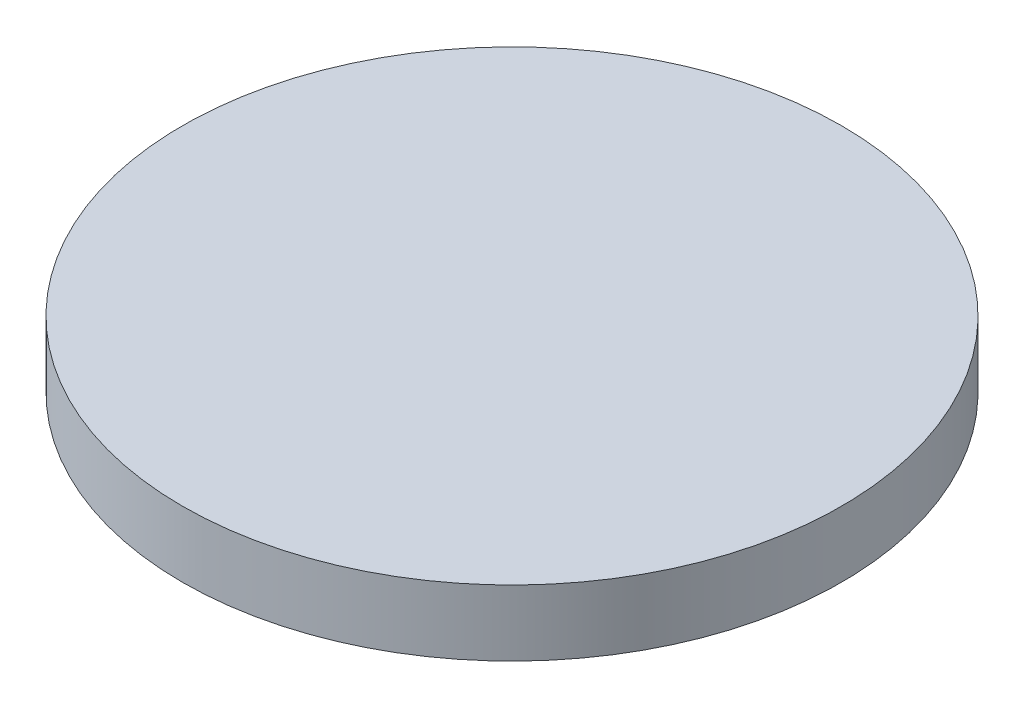
ISO-10303-21;
HEADER;
FILE_DESCRIPTION(('STEP AP214'),'2;1');
FILE_NAME('part.step','',(''),(''),'','','');
FILE_SCHEMA(('AUTOMOTIVE_DESIGN { 1 0 10303 214 1 1 1 1 }'));
ENDSEC;
DATA;
#1=APPLICATION_CONTEXT('core data for automotive mechanical design processes');
#2=APPLICATION_PROTOCOL_DEFINITION('international standard','automotive_design',2000,#1);
#3=PRODUCT_CONTEXT('',#1,'mechanical');
#4=PRODUCT('Part','Part','',(#3));
#5=PRODUCT_RELATED_PRODUCT_CATEGORY('part','',(#4));
#6=PRODUCT_DEFINITION_FORMATION('','',#4);
#7=PRODUCT_DEFINITION_CONTEXT('part definition',#1,'design');
#8=PRODUCT_DEFINITION('design','',#6,#7);
#9=PRODUCT_DEFINITION_SHAPE('','',#8);
#10=(LENGTH_UNIT() NAMED_UNIT(*) SI_UNIT(.MILLI.,.METRE.));
#11=(NAMED_UNIT(*) PLANE_ANGLE_UNIT() SI_UNIT($,.RADIAN.));
#12=(NAMED_UNIT(*) SI_UNIT($,.STERADIAN.) SOLID_ANGLE_UNIT());
#13=UNCERTAINTY_MEASURE_WITH_UNIT(LENGTH_MEASURE(1.E-05),#10,'distance_accuracy_value','');
#14=(GEOMETRIC_REPRESENTATION_CONTEXT(3) GLOBAL_UNCERTAINTY_ASSIGNED_CONTEXT((#13)) GLOBAL_UNIT_ASSIGNED_CONTEXT((#10,
#11,#12)) REPRESENTATION_CONTEXT('',''));
#15=CARTESIAN_POINT('',(0.,0.,0.));
#16=DIRECTION('',(0.,0.,1.));
#17=DIRECTION('',(1.,0.,0.));
#18=AXIS2_PLACEMENT_3D('',#15,#16,#17);
#19=CARTESIAN_POINT('',(0.,10.,0.));
#20=DIRECTION('',(0.,-1.,0.));
#21=DIRECTION('',(0.,0.,-1.));
#22=AXIS2_PLACEMENT_3D('',#19,#20,#21);
#23=CYLINDRICAL_SURFACE('',#22,50.);
#24=CARTESIAN_POINT('',(0.,10.,0.));
#25=DIRECTION('',(0.,1.,0.));
#26=DIRECTION('',(0.,0.,1.));
#27=AXIS2_PLACEMENT_3D('',#24,#25,#26);
#28=CIRCLE('',#27,50.);
#29=CARTESIAN_POINT('',(0.,10.,50.));
#30=VERTEX_POINT('',#29);
#31=EDGE_CURVE('E10',#30,#30,#28,.T.);
#32=ORIENTED_EDGE('',*,*,#31,.F.);
#33=EDGE_LOOP('',(#32));
#34=FACE_BOUND('',#33,.T.);
#35=CARTESIAN_POINT('',(0.,0.,0.));
#36=DIRECTION('',(0.,1.,0.));
#37=DIRECTION('',(0.,0.,1.));
#38=AXIS2_PLACEMENT_3D('',#35,#36,#37);
#39=CIRCLE('',#38,50.);
#40=CARTESIAN_POINT('',(0.,0.,50.));
#41=VERTEX_POINT('',#40);
#42=EDGE_CURVE('E32',#41,#41,#39,.T.);
#43=ORIENTED_EDGE('',*,*,#42,.T.);
#44=EDGE_LOOP('',(#43));
#45=FACE_BOUND('',#44,.T.);
#46=ADVANCED_FACE('F29',(#34,#45),#23,.T.);
#47=CARTESIAN_POINT('',(0.,10.,0.));
#48=DIRECTION('',(0.,1.,0.));
#49=DIRECTION('',(0.,0.,1.));
#50=AXIS2_PLACEMENT_3D('',#47,#48,#49);
#51=PLANE('',#50);
#52=ORIENTED_EDGE('',*,*,#31,.T.);
#53=EDGE_LOOP('',(#52));
#54=FACE_BOUND('',#53,.T.);
#55=ADVANCED_FACE('F44',(#54),#51,.T.);
#56=CARTESIAN_POINT('',(0.,0.,0.));
#57=DIRECTION('',(0.,1.,0.));
#58=DIRECTION('',(0.,0.,1.));
#59=AXIS2_PLACEMENT_3D('',#56,#57,#58);
#60=PLANE('',#59);
#61=ORIENTED_EDGE('',*,*,#42,.F.);
#62=EDGE_LOOP('',(#61));
#63=FACE_BOUND('',#62,.T.);
#64=ADVANCED_FACE('F42',(#63),#60,.F.);
#65=CLOSED_SHELL('',(#46,#55,#64));
#66=MANIFOLD_SOLID_BREP('B2',#65);
#67=ADVANCED_BREP_SHAPE_REPRESENTATION('',(#18,#66),#14);
#68=SHAPE_DEFINITION_REPRESENTATION(#9,#67);
ENDSEC;
END-ISO-10303-21;
